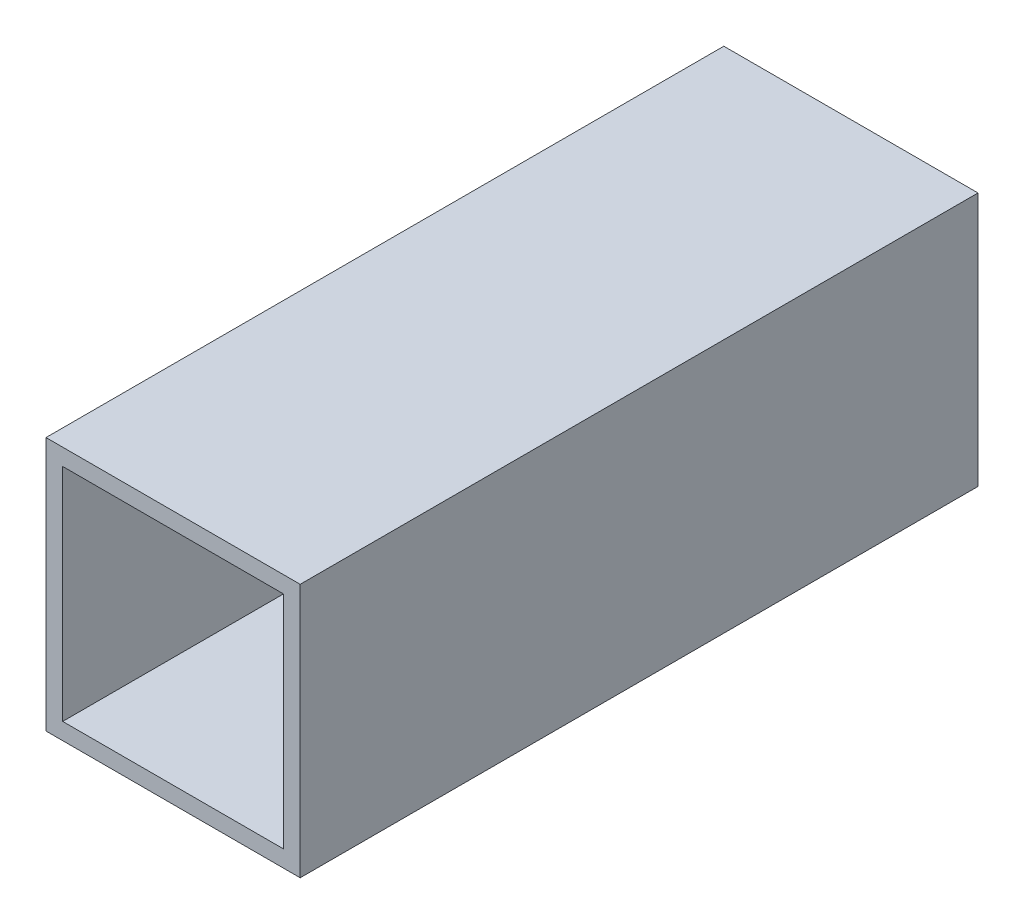
ISO-10303-21;
HEADER;
FILE_DESCRIPTION(('STEP AP214'),'2;1');
FILE_NAME('part.step','',(''),(''),'','','');
FILE_SCHEMA(('AUTOMOTIVE_DESIGN { 1 0 10303 214 1 1 1 1 }'));
ENDSEC;
DATA;
#1=APPLICATION_CONTEXT('core data for automotive mechanical design processes');
#2=APPLICATION_PROTOCOL_DEFINITION('international standard','automotive_design',2000,#1);
#3=PRODUCT_CONTEXT('',#1,'mechanical');
#4=PRODUCT('Part','Part','',(#3));
#5=PRODUCT_RELATED_PRODUCT_CATEGORY('part','',(#4));
#6=PRODUCT_DEFINITION_FORMATION('','',#4);
#7=PRODUCT_DEFINITION_CONTEXT('part definition',#1,'design');
#8=PRODUCT_DEFINITION('design','',#6,#7);
#9=PRODUCT_DEFINITION_SHAPE('','',#8);
#10=(LENGTH_UNIT() NAMED_UNIT(*) SI_UNIT(.MILLI.,.METRE.));
#11=(NAMED_UNIT(*) PLANE_ANGLE_UNIT() SI_UNIT($,.RADIAN.));
#12=(NAMED_UNIT(*) SI_UNIT($,.STERADIAN.) SOLID_ANGLE_UNIT());
#13=UNCERTAINTY_MEASURE_WITH_UNIT(LENGTH_MEASURE(1.E-05),#10,'distance_accuracy_value','');
#14=(GEOMETRIC_REPRESENTATION_CONTEXT(3) GLOBAL_UNCERTAINTY_ASSIGNED_CONTEXT((#13)) GLOBAL_UNIT_ASSIGNED_CONTEXT((#10,
#11,#12)) REPRESENTATION_CONTEXT('',''));
#15=CARTESIAN_POINT('',(0.,0.,0.));
#16=DIRECTION('',(0.,0.,1.));
#17=DIRECTION('',(1.,0.,0.));
#18=AXIS2_PLACEMENT_3D('',#15,#16,#17);
#19=CARTESIAN_POINT('',(0.,0.,203.2));
#20=DIRECTION('',(0.,0.,-1.));
#21=DIRECTION('',(-1.,0.,0.));
#22=AXIS2_PLACEMENT_3D('',#19,#20,#21);
#23=PLANE('',#22);
#24=DIRECTION('',(0.,1.,0.));
#25=VECTOR('',#24,1.);
#26=CARTESIAN_POINT('',(38.1,-38.1,203.2));
#27=LINE('',#26,#25);
#28=CARTESIAN_POINT('',(38.1,-38.1,203.2));
#29=VERTEX_POINT('',#28);
#30=CARTESIAN_POINT('',(38.1,38.1,203.2));
#31=VERTEX_POINT('',#30);
#32=EDGE_CURVE('E138',#29,#31,#27,.T.);
#33=ORIENTED_EDGE('',*,*,#32,.T.);
#34=DIRECTION('',(-1.,0.,0.));
#35=VECTOR('',#34,1.);
#36=CARTESIAN_POINT('',(-38.1,38.1,203.2));
#37=LINE('',#36,#35);
#38=CARTESIAN_POINT('',(-38.1,38.1,203.2));
#39=VERTEX_POINT('',#38);
#40=EDGE_CURVE('E141',#31,#39,#37,.T.);
#41=ORIENTED_EDGE('',*,*,#40,.T.);
#42=DIRECTION('',(0.,-1.,0.));
#43=VECTOR('',#42,1.);
#44=CARTESIAN_POINT('',(-38.1,-38.1,203.2));
#45=LINE('',#44,#43);
#46=CARTESIAN_POINT('',(-38.1,-38.1,203.2));
#47=VERTEX_POINT('',#46);
#48=EDGE_CURVE('E144',#39,#47,#45,.T.);
#49=ORIENTED_EDGE('',*,*,#48,.T.);
#50=DIRECTION('',(1.,0.,0.));
#51=VECTOR('',#50,1.);
#52=CARTESIAN_POINT('',(-38.1,-38.1,203.2));
#53=LINE('',#52,#51);
#54=EDGE_CURVE('E146',#47,#29,#53,.T.);
#55=ORIENTED_EDGE('',*,*,#54,.T.);
#56=EDGE_LOOP('',(#33,#41,#49,#55));
#57=FACE_BOUND('',#56,.T.);
#58=DIRECTION('',(0.,-1.,0.));
#59=VECTOR('',#58,1.);
#60=CARTESIAN_POINT('',(-33.1,-33.1,203.2));
#61=LINE('',#60,#59);
#62=CARTESIAN_POINT('',(-33.1,33.1,203.2));
#63=VERTEX_POINT('',#62);
#64=CARTESIAN_POINT('',(-33.1,-33.1,203.2));
#65=VERTEX_POINT('',#64);
#66=EDGE_CURVE('E102',#63,#65,#61,.T.);
#67=ORIENTED_EDGE('',*,*,#66,.F.);
#68=DIRECTION('',(-1.,0.,0.));
#69=VECTOR('',#68,1.);
#70=CARTESIAN_POINT('',(-33.1,33.1,203.2));
#71=LINE('',#70,#69);
#72=CARTESIAN_POINT('',(33.1,33.1,203.2));
#73=VERTEX_POINT('',#72);
#74=EDGE_CURVE('E124',#73,#63,#71,.T.);
#75=ORIENTED_EDGE('',*,*,#74,.F.);
#76=DIRECTION('',(0.,1.,0.));
#77=VECTOR('',#76,1.);
#78=CARTESIAN_POINT('',(33.1,-33.1,203.2));
#79=LINE('',#78,#77);
#80=CARTESIAN_POINT('',(33.1,-33.1,203.2));
#81=VERTEX_POINT('',#80);
#82=EDGE_CURVE('E122',#81,#73,#79,.T.);
#83=ORIENTED_EDGE('',*,*,#82,.F.);
#84=DIRECTION('',(1.,0.,0.));
#85=VECTOR('',#84,1.);
#86=CARTESIAN_POINT('',(-33.1,-33.1,203.2));
#87=LINE('',#86,#85);
#88=EDGE_CURVE('E110',#65,#81,#87,.T.);
#89=ORIENTED_EDGE('',*,*,#88,.F.);
#90=EDGE_LOOP('',(#67,#75,#83,#89));
#91=FACE_BOUND('',#90,.T.);
#92=ADVANCED_FACE('F37',(#57,#91),#23,.F.);
#93=CARTESIAN_POINT('',(0.,0.,0.));
#94=DIRECTION('',(0.,0.,-1.));
#95=DIRECTION('',(-1.,0.,0.));
#96=AXIS2_PLACEMENT_3D('',#93,#94,#95);
#97=PLANE('',#96);
#98=DIRECTION('',(0.,1.,0.));
#99=VECTOR('',#98,1.);
#100=CARTESIAN_POINT('',(38.1,-38.1,0.));
#101=LINE('',#100,#99);
#102=CARTESIAN_POINT('',(38.1,-38.1,0.));
#103=VERTEX_POINT('',#102);
#104=CARTESIAN_POINT('',(38.1,38.1,0.));
#105=VERTEX_POINT('',#104);
#106=EDGE_CURVE('E118',#103,#105,#101,.T.);
#107=ORIENTED_EDGE('',*,*,#106,.F.);
#108=DIRECTION('',(1.,0.,0.));
#109=VECTOR('',#108,1.);
#110=CARTESIAN_POINT('',(-38.1,-38.1,0.));
#111=LINE('',#110,#109);
#112=CARTESIAN_POINT('',(-38.1,-38.1,0.));
#113=VERTEX_POINT('',#112);
#114=EDGE_CURVE('E142',#113,#103,#111,.T.);
#115=ORIENTED_EDGE('',*,*,#114,.F.);
#116=DIRECTION('',(0.,-1.,0.));
#117=VECTOR('',#116,1.);
#118=CARTESIAN_POINT('',(-38.1,-38.1,0.));
#119=LINE('',#118,#117);
#120=CARTESIAN_POINT('',(-38.1,38.1,0.));
#121=VERTEX_POINT('',#120);
#122=EDGE_CURVE('E153',#121,#113,#119,.T.);
#123=ORIENTED_EDGE('',*,*,#122,.F.);
#124=DIRECTION('',(-1.,0.,0.));
#125=VECTOR('',#124,1.);
#126=CARTESIAN_POINT('',(-38.1,38.1,0.));
#127=LINE('',#126,#125);
#128=EDGE_CURVE('E151',#105,#121,#127,.T.);
#129=ORIENTED_EDGE('',*,*,#128,.F.);
#130=EDGE_LOOP('',(#107,#115,#123,#129));
#131=FACE_BOUND('',#130,.T.);
#132=DIRECTION('',(-1.,0.,0.));
#133=VECTOR('',#132,1.);
#134=CARTESIAN_POINT('',(-33.1,33.1,0.));
#135=LINE('',#134,#133);
#136=CARTESIAN_POINT('',(33.1,33.1,0.));
#137=VERTEX_POINT('',#136);
#138=CARTESIAN_POINT('',(-33.1,33.1,0.));
#139=VERTEX_POINT('',#138);
#140=EDGE_CURVE('E111',#137,#139,#135,.T.);
#141=ORIENTED_EDGE('',*,*,#140,.T.);
#142=DIRECTION('',(0.,-1.,0.));
#143=VECTOR('',#142,1.);
#144=CARTESIAN_POINT('',(-33.1,-33.1,0.));
#145=LINE('',#144,#143);
#146=CARTESIAN_POINT('',(-33.1,-33.1,0.));
#147=VERTEX_POINT('',#146);
#148=EDGE_CURVE('E60',#139,#147,#145,.T.);
#149=ORIENTED_EDGE('',*,*,#148,.T.);
#150=DIRECTION('',(1.,0.,0.));
#151=VECTOR('',#150,1.);
#152=CARTESIAN_POINT('',(-33.1,-33.1,0.));
#153=LINE('',#152,#151);
#154=CARTESIAN_POINT('',(33.1,-33.1,0.));
#155=VERTEX_POINT('',#154);
#156=EDGE_CURVE('E117',#147,#155,#153,.T.);
#157=ORIENTED_EDGE('',*,*,#156,.T.);
#158=DIRECTION('',(0.,1.,0.));
#159=VECTOR('',#158,1.);
#160=CARTESIAN_POINT('',(33.1,-33.1,0.));
#161=LINE('',#160,#159);
#162=EDGE_CURVE('E130',#155,#137,#161,.T.);
#163=ORIENTED_EDGE('',*,*,#162,.T.);
#164=EDGE_LOOP('',(#141,#149,#157,#163));
#165=FACE_BOUND('',#164,.T.);
#166=ADVANCED_FACE('F171',(#131,#165),#97,.T.);
#167=CARTESIAN_POINT('',(38.1,-38.1,203.2));
#168=DIRECTION('',(-1.,0.,0.));
#169=DIRECTION('',(0.,0.,1.));
#170=AXIS2_PLACEMENT_3D('',#167,#168,#169);
#171=PLANE('',#170);
#172=ORIENTED_EDGE('',*,*,#106,.T.);
#173=DIRECTION('',(0.,0.,-1.));
#174=VECTOR('',#173,1.);
#175=CARTESIAN_POINT('',(38.1,38.1,203.2));
#176=LINE('',#175,#174);
#177=EDGE_CURVE('E11',#31,#105,#176,.T.);
#178=ORIENTED_EDGE('',*,*,#177,.F.);
#179=ORIENTED_EDGE('',*,*,#32,.F.);
#180=DIRECTION('',(0.,0.,-1.));
#181=VECTOR('',#180,1.);
#182=CARTESIAN_POINT('',(38.1,-38.1,203.2));
#183=LINE('',#182,#181);
#184=EDGE_CURVE('E148',#29,#103,#183,.T.);
#185=ORIENTED_EDGE('',*,*,#184,.T.);
#186=EDGE_LOOP('',(#172,#178,#179,#185));
#187=FACE_BOUND('',#186,.T.);
#188=ADVANCED_FACE('F39',(#187),#171,.F.);
#189=CARTESIAN_POINT('',(-38.1,38.1,203.2));
#190=DIRECTION('',(0.,-1.,0.));
#191=DIRECTION('',(0.,0.,-1.));
#192=AXIS2_PLACEMENT_3D('',#189,#190,#191);
#193=PLANE('',#192);
#194=ORIENTED_EDGE('',*,*,#128,.T.);
#195=DIRECTION('',(0.,0.,-1.));
#196=VECTOR('',#195,1.);
#197=CARTESIAN_POINT('',(-38.1,38.1,203.2));
#198=LINE('',#197,#196);
#199=EDGE_CURVE('E45',#39,#121,#198,.T.);
#200=ORIENTED_EDGE('',*,*,#199,.F.);
#201=ORIENTED_EDGE('',*,*,#40,.F.);
#202=ORIENTED_EDGE('',*,*,#177,.T.);
#203=EDGE_LOOP('',(#194,#200,#201,#202));
#204=FACE_BOUND('',#203,.T.);
#205=ADVANCED_FACE('F181',(#204),#193,.F.);
#206=CARTESIAN_POINT('',(-38.1,-38.1,203.2));
#207=DIRECTION('',(1.,0.,0.));
#208=DIRECTION('',(0.,0.,-1.));
#209=AXIS2_PLACEMENT_3D('',#206,#207,#208);
#210=PLANE('',#209);
#211=ORIENTED_EDGE('',*,*,#122,.T.);
#212=DIRECTION('',(0.,0.,-1.));
#213=VECTOR('',#212,1.);
#214=CARTESIAN_POINT('',(-38.1,-38.1,203.2));
#215=LINE('',#214,#213);
#216=EDGE_CURVE('E158',#47,#113,#215,.T.);
#217=ORIENTED_EDGE('',*,*,#216,.F.);
#218=ORIENTED_EDGE('',*,*,#48,.F.);
#219=ORIENTED_EDGE('',*,*,#199,.T.);
#220=EDGE_LOOP('',(#211,#217,#218,#219));
#221=FACE_BOUND('',#220,.T.);
#222=ADVANCED_FACE('F165',(#221),#210,.F.);
#223=CARTESIAN_POINT('',(-38.1,-38.1,203.2));
#224=DIRECTION('',(0.,1.,0.));
#225=DIRECTION('',(0.,0.,1.));
#226=AXIS2_PLACEMENT_3D('',#223,#224,#225);
#227=PLANE('',#226);
#228=ORIENTED_EDGE('',*,*,#114,.T.);
#229=ORIENTED_EDGE('',*,*,#184,.F.);
#230=ORIENTED_EDGE('',*,*,#54,.F.);
#231=ORIENTED_EDGE('',*,*,#216,.T.);
#232=EDGE_LOOP('',(#228,#229,#230,#231));
#233=FACE_BOUND('',#232,.T.);
#234=ADVANCED_FACE('F175',(#233),#227,.F.);
#235=CARTESIAN_POINT('',(-33.1,-33.1,203.2));
#236=DIRECTION('',(1.,0.,0.));
#237=DIRECTION('',(0.,0.,-1.));
#238=AXIS2_PLACEMENT_3D('',#235,#236,#237);
#239=PLANE('',#238);
#240=ORIENTED_EDGE('',*,*,#148,.F.);
#241=DIRECTION('',(0.,0.,-1.));
#242=VECTOR('',#241,1.);
#243=CARTESIAN_POINT('',(-33.1,33.1,203.2));
#244=LINE('',#243,#242);
#245=EDGE_CURVE('E106',#63,#139,#244,.T.);
#246=ORIENTED_EDGE('',*,*,#245,.F.);
#247=ORIENTED_EDGE('',*,*,#66,.T.);
#248=DIRECTION('',(0.,0.,-1.));
#249=VECTOR('',#248,1.);
#250=CARTESIAN_POINT('',(-33.1,-33.1,203.2));
#251=LINE('',#250,#249);
#252=EDGE_CURVE('E105',#65,#147,#251,.T.);
#253=ORIENTED_EDGE('',*,*,#252,.T.);
#254=EDGE_LOOP('',(#240,#246,#247,#253));
#255=FACE_BOUND('',#254,.T.);
#256=ADVANCED_FACE('F104',(#255),#239,.T.);
#257=CARTESIAN_POINT('',(-33.1,-33.1,203.2));
#258=DIRECTION('',(0.,1.,0.));
#259=DIRECTION('',(0.,0.,1.));
#260=AXIS2_PLACEMENT_3D('',#257,#258,#259);
#261=PLANE('',#260);
#262=ORIENTED_EDGE('',*,*,#156,.F.);
#263=ORIENTED_EDGE('',*,*,#252,.F.);
#264=ORIENTED_EDGE('',*,*,#88,.T.);
#265=DIRECTION('',(0.,0.,-1.));
#266=VECTOR('',#265,1.);
#267=CARTESIAN_POINT('',(33.1,-33.1,203.2));
#268=LINE('',#267,#266);
#269=EDGE_CURVE('E119',#81,#155,#268,.T.);
#270=ORIENTED_EDGE('',*,*,#269,.T.);
#271=EDGE_LOOP('',(#262,#263,#264,#270));
#272=FACE_BOUND('',#271,.T.);
#273=ADVANCED_FACE('F114',(#272),#261,.T.);
#274=CARTESIAN_POINT('',(33.1,-33.1,203.2));
#275=DIRECTION('',(-1.,0.,0.));
#276=DIRECTION('',(0.,-1.,0.));
#277=AXIS2_PLACEMENT_3D('',#274,#275,#276);
#278=PLANE('',#277);
#279=ORIENTED_EDGE('',*,*,#162,.F.);
#280=ORIENTED_EDGE('',*,*,#269,.F.);
#281=ORIENTED_EDGE('',*,*,#82,.T.);
#282=DIRECTION('',(0.,0.,-1.));
#283=VECTOR('',#282,1.);
#284=CARTESIAN_POINT('',(33.1,33.1,203.2));
#285=LINE('',#284,#283);
#286=EDGE_CURVE('E52',#73,#137,#285,.T.);
#287=ORIENTED_EDGE('',*,*,#286,.T.);
#288=EDGE_LOOP('',(#279,#280,#281,#287));
#289=FACE_BOUND('',#288,.T.);
#290=ADVANCED_FACE('F204',(#289),#278,.T.);
#291=CARTESIAN_POINT('',(-33.1,33.1,203.2));
#292=DIRECTION('',(0.,-1.,0.));
#293=DIRECTION('',(1.,0.,0.));
#294=AXIS2_PLACEMENT_3D('',#291,#292,#293);
#295=PLANE('',#294);
#296=ORIENTED_EDGE('',*,*,#140,.F.);
#297=ORIENTED_EDGE('',*,*,#286,.F.);
#298=ORIENTED_EDGE('',*,*,#74,.T.);
#299=ORIENTED_EDGE('',*,*,#245,.T.);
#300=EDGE_LOOP('',(#296,#297,#298,#299));
#301=FACE_BOUND('',#300,.T.);
#302=ADVANCED_FACE('F208',(#301),#295,.T.);
#303=CLOSED_SHELL('',(#92,#166,#188,#205,#222,#234,#256,#273,#290,#302));
#304=MANIFOLD_SOLID_BREP('B2',#303);
#305=ADVANCED_BREP_SHAPE_REPRESENTATION('',(#18,#304),#14);
#306=SHAPE_DEFINITION_REPRESENTATION(#9,#305);
ENDSEC;
END-ISO-10303-21;
